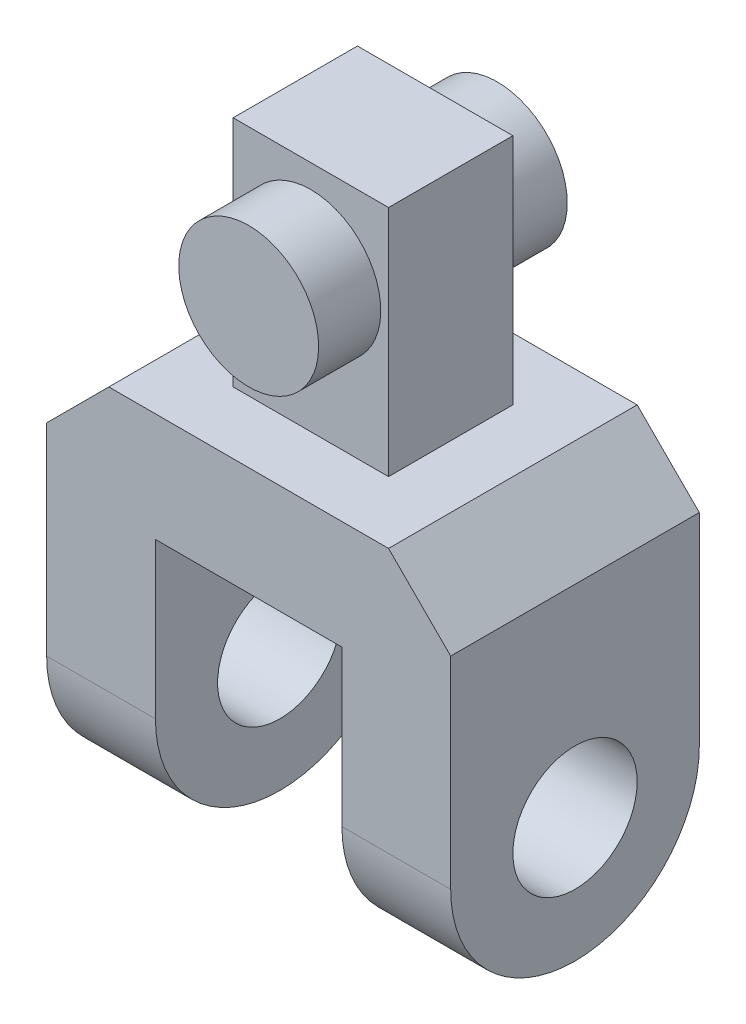
ISO-10303-21;
HEADER;
FILE_DESCRIPTION(('STEP AP214'),'2;1');
FILE_NAME('part.step','',(''),(''),'','','');
FILE_SCHEMA(('AUTOMOTIVE_DESIGN { 1 0 10303 214 1 1 1 1 }'));
ENDSEC;
DATA;
#1=APPLICATION_CONTEXT('core data for automotive mechanical design processes');
#2=APPLICATION_PROTOCOL_DEFINITION('international standard','automotive_design',2000,#1);
#3=PRODUCT_CONTEXT('',#1,'mechanical');
#4=PRODUCT('Part','Part','',(#3));
#5=PRODUCT_RELATED_PRODUCT_CATEGORY('part','',(#4));
#6=PRODUCT_DEFINITION_FORMATION('','',#4);
#7=PRODUCT_DEFINITION_CONTEXT('part definition',#1,'design');
#8=PRODUCT_DEFINITION('design','',#6,#7);
#9=PRODUCT_DEFINITION_SHAPE('','',#8);
#10=(LENGTH_UNIT() NAMED_UNIT(*) SI_UNIT(.MILLI.,.METRE.));
#11=(NAMED_UNIT(*) PLANE_ANGLE_UNIT() SI_UNIT($,.RADIAN.));
#12=(NAMED_UNIT(*) SI_UNIT($,.STERADIAN.) SOLID_ANGLE_UNIT());
#13=UNCERTAINTY_MEASURE_WITH_UNIT(LENGTH_MEASURE(1.E-05),#10,'distance_accuracy_value','');
#14=(GEOMETRIC_REPRESENTATION_CONTEXT(3) GLOBAL_UNCERTAINTY_ASSIGNED_CONTEXT((#13)) GLOBAL_UNIT_ASSIGNED_CONTEXT((#10,
#11,#12)) REPRESENTATION_CONTEXT('',''));
#15=CARTESIAN_POINT('',(0.,0.,0.));
#16=DIRECTION('',(0.,0.,1.));
#17=DIRECTION('',(1.,0.,0.));
#18=AXIS2_PLACEMENT_3D('',#15,#16,#17);
#19=CARTESIAN_POINT('',(-5.,32.,4.00000000000002));
#20=DIRECTION('',(0.,0.,-1.));
#21=DIRECTION('',(0.,1.,0.));
#22=AXIS2_PLACEMENT_3D('',#19,#20,#21);
#23=PLANE('',#22);
#24=DIRECTION('',(1.,0.,0.));
#25=VECTOR('',#24,1.);
#26=CARTESIAN_POINT('',(-5.,17.,4.00000000000001));
#27=LINE('',#26,#25);
#28=CARTESIAN_POINT('',(-5.,17.,4.00000000000001));
#29=VERTEX_POINT('',#28);
#30=CARTESIAN_POINT('',(5.,17.,4.00000000000001));
#31=VERTEX_POINT('',#30);
#32=EDGE_CURVE('E368',#29,#31,#27,.T.);
#33=ORIENTED_EDGE('',*,*,#32,.T.);
#34=DIRECTION('',(0.,-1.,0.));
#35=VECTOR('',#34,1.);
#36=CARTESIAN_POINT('',(5.,32.,4.00000000000002));
#37=LINE('',#36,#35);
#38=CARTESIAN_POINT('',(5.,32.,4.00000000000002));
#39=VERTEX_POINT('',#38);
#40=EDGE_CURVE('E143',#39,#31,#37,.T.);
#41=ORIENTED_EDGE('',*,*,#40,.F.);
#42=DIRECTION('',(1.,0.,0.));
#43=VECTOR('',#42,1.);
#44=CARTESIAN_POINT('',(-5.,32.,4.00000000000002));
#45=LINE('',#44,#43);
#46=CARTESIAN_POINT('',(-5.,32.,4.00000000000002));
#47=VERTEX_POINT('',#46);
#48=EDGE_CURVE('E136',#47,#39,#45,.T.);
#49=ORIENTED_EDGE('',*,*,#48,.F.);
#50=DIRECTION('',(0.,-1.,0.));
#51=VECTOR('',#50,1.);
#52=CARTESIAN_POINT('',(-5.,32.,4.00000000000002));
#53=LINE('',#52,#51);
#54=EDGE_CURVE('E140',#47,#29,#53,.T.);
#55=ORIENTED_EDGE('',*,*,#54,.T.);
#56=EDGE_LOOP('',(#33,#41,#49,#55));
#57=FACE_BOUND('',#56,.T.);
#58=CARTESIAN_POINT('',(0.,26.,4.00000000000001));
#59=DIRECTION('',(0.,0.,-1.));
#60=DIRECTION('',(0.,1.,0.));
#61=AXIS2_PLACEMENT_3D('',#58,#59,#60);
#62=CIRCLE('',#61,4.5);
#63=CARTESIAN_POINT('',(0.,30.5,4.00000000000002));
#64=VERTEX_POINT('',#63);
#65=EDGE_CURVE('E11',#64,#64,#62,.F.);
#66=ORIENTED_EDGE('',*,*,#65,.F.);
#67=EDGE_LOOP('',(#66));
#68=FACE_BOUND('',#67,.T.);
#69=ADVANCED_FACE('F34',(#57,#68),#23,.F.);
#70=CARTESIAN_POINT('',(-5.,32.,-3.99999999999999));
#71=DIRECTION('',(0.,0.,1.));
#72=DIRECTION('',(0.,-1.,0.));
#73=AXIS2_PLACEMENT_3D('',#70,#71,#72);
#74=PLANE('',#73);
#75=DIRECTION('',(-1.,0.,0.));
#76=VECTOR('',#75,1.);
#77=CARTESIAN_POINT('',(-5.,17.,-3.99999999999999));
#78=LINE('',#77,#76);
#79=CARTESIAN_POINT('',(5.,17.,-3.99999999999999));
#80=VERTEX_POINT('',#79);
#81=CARTESIAN_POINT('',(-5.,17.,-3.99999999999999));
#82=VERTEX_POINT('',#81);
#83=EDGE_CURVE('E155',#80,#82,#78,.T.);
#84=ORIENTED_EDGE('',*,*,#83,.T.);
#85=DIRECTION('',(0.,-1.,0.));
#86=VECTOR('',#85,1.);
#87=CARTESIAN_POINT('',(-5.,32.,-3.99999999999999));
#88=LINE('',#87,#86);
#89=CARTESIAN_POINT('',(-5.,32.,-3.99999999999999));
#90=VERTEX_POINT('',#89);
#91=EDGE_CURVE('E378',#90,#82,#88,.T.);
#92=ORIENTED_EDGE('',*,*,#91,.F.);
#93=DIRECTION('',(-1.,0.,0.));
#94=VECTOR('',#93,1.);
#95=CARTESIAN_POINT('',(-5.,32.,-3.99999999999999));
#96=LINE('',#95,#94);
#97=CARTESIAN_POINT('',(5.,32.,-3.99999999999999));
#98=VERTEX_POINT('',#97);
#99=EDGE_CURVE('E151',#98,#90,#96,.T.);
#100=ORIENTED_EDGE('',*,*,#99,.F.);
#101=DIRECTION('',(0.,-1.,0.));
#102=VECTOR('',#101,1.);
#103=CARTESIAN_POINT('',(5.,32.,-3.99999999999999));
#104=LINE('',#103,#102);
#105=EDGE_CURVE('E50',#98,#80,#104,.T.);
#106=ORIENTED_EDGE('',*,*,#105,.T.);
#107=EDGE_LOOP('',(#84,#92,#100,#106));
#108=FACE_BOUND('',#107,.T.);
#109=CARTESIAN_POINT('',(0.,26.,-3.99999999999999));
#110=DIRECTION('',(0.,0.,1.));
#111=DIRECTION('',(0.,-1.,0.));
#112=AXIS2_PLACEMENT_3D('',#109,#110,#111);
#113=CIRCLE('',#112,4.5);
#114=CARTESIAN_POINT('',(0.,21.5,-3.99999999999999));
#115=VERTEX_POINT('',#114);
#116=EDGE_CURVE('E38',#115,#115,#113,.F.);
#117=ORIENTED_EDGE('',*,*,#116,.F.);
#118=EDGE_LOOP('',(#117));
#119=FACE_BOUND('',#118,.T.);
#120=ADVANCED_FACE('F230',(#108,#119),#74,.F.);
#121=CARTESIAN_POINT('',(-13.,17.,8.00000000000001));
#122=DIRECTION('',(0.,1.,0.));
#123=DIRECTION('',(0.,0.,1.));
#124=AXIS2_PLACEMENT_3D('',#121,#122,#123);
#125=PLANE('',#124);
#126=DIRECTION('',(1.,0.,0.));
#127=VECTOR('',#126,1.);
#128=CARTESIAN_POINT('',(-13.,17.,8.00000000000001));
#129=LINE('',#128,#127);
#130=CARTESIAN_POINT('',(-9.,17.,8.00000000000001));
#131=VERTEX_POINT('',#130);
#132=CARTESIAN_POINT('',(8.99999999999999,17.,8.00000000000001));
#133=VERTEX_POINT('',#132);
#134=EDGE_CURVE('E189',#131,#133,#129,.T.);
#135=ORIENTED_EDGE('',*,*,#134,.T.);
#136=DIRECTION('',(0.,0.,-1.));
#137=VECTOR('',#136,1.);
#138=CARTESIAN_POINT('',(9.,17.,8.00000000000001));
#139=LINE('',#138,#137);
#140=CARTESIAN_POINT('',(8.99999999999999,17.,-7.99999999999999));
#141=VERTEX_POINT('',#140);
#142=EDGE_CURVE('E209',#133,#141,#139,.T.);
#143=ORIENTED_EDGE('',*,*,#142,.T.);
#144=DIRECTION('',(-1.,0.,0.));
#145=VECTOR('',#144,1.);
#146=CARTESIAN_POINT('',(-13.,17.,-7.99999999999999));
#147=LINE('',#146,#145);
#148=CARTESIAN_POINT('',(-9.00000000000001,17.,-7.99999999999999));
#149=VERTEX_POINT('',#148);
#150=EDGE_CURVE('E192',#141,#149,#147,.T.);
#151=ORIENTED_EDGE('',*,*,#150,.T.);
#152=DIRECTION('',(0.,0.,1.));
#153=VECTOR('',#152,1.);
#154=CARTESIAN_POINT('',(-9.,17.,8.00000000000001));
#155=LINE('',#154,#153);
#156=EDGE_CURVE('E206',#149,#131,#155,.T.);
#157=ORIENTED_EDGE('',*,*,#156,.T.);
#158=EDGE_LOOP('',(#135,#143,#151,#157));
#159=FACE_BOUND('',#158,.T.);
#160=ORIENTED_EDGE('',*,*,#32,.F.);
#161=DIRECTION('',(0.,0.,1.));
#162=VECTOR('',#161,1.);
#163=CARTESIAN_POINT('',(-5.,17.,4.00000000000001));
#164=LINE('',#163,#162);
#165=EDGE_CURVE('E159',#82,#29,#164,.T.);
#166=ORIENTED_EDGE('',*,*,#165,.F.);
#167=ORIENTED_EDGE('',*,*,#83,.F.);
#168=DIRECTION('',(0.,0.,-1.));
#169=VECTOR('',#168,1.);
#170=CARTESIAN_POINT('',(5.,17.,4.00000000000001));
#171=LINE('',#170,#169);
#172=EDGE_CURVE('E370',#31,#80,#171,.T.);
#173=ORIENTED_EDGE('',*,*,#172,.F.);
#174=EDGE_LOOP('',(#160,#166,#167,#173));
#175=FACE_BOUND('',#174,.T.);
#176=ADVANCED_FACE('F232',(#159,#175),#125,.T.);
#177=CARTESIAN_POINT('',(13.,0.,0.));
#178=DIRECTION('',(1.,0.,0.));
#179=DIRECTION('',(0.,0.,-1.));
#180=AXIS2_PLACEMENT_3D('',#177,#178,#179);
#181=PLANE('',#180);
#182=DIRECTION('',(0.,1.,0.));
#183=VECTOR('',#182,1.);
#184=CARTESIAN_POINT('',(13.,0.,-8.));
#185=LINE('',#184,#183);
#186=CARTESIAN_POINT('',(13.,0.,-8.));
#187=VERTEX_POINT('',#186);
#188=CARTESIAN_POINT('',(13.,13.,-8.));
#189=VERTEX_POINT('',#188);
#190=EDGE_CURVE('E326',#187,#189,#185,.T.);
#191=ORIENTED_EDGE('',*,*,#190,.T.);
#192=DIRECTION('',(0.,0.,1.));
#193=VECTOR('',#192,1.);
#194=CARTESIAN_POINT('',(13.,13.,0.));
#195=LINE('',#194,#193);
#196=CARTESIAN_POINT('',(13.,13.,8.));
#197=VERTEX_POINT('',#196);
#198=EDGE_CURVE('E217',#189,#197,#195,.T.);
#199=ORIENTED_EDGE('',*,*,#198,.T.);
#200=DIRECTION('',(0.,-1.,0.));
#201=VECTOR('',#200,1.);
#202=CARTESIAN_POINT('',(13.,0.,8.));
#203=LINE('',#202,#201);
#204=CARTESIAN_POINT('',(13.,0.,8.));
#205=VERTEX_POINT('',#204);
#206=EDGE_CURVE('E303',#197,#205,#203,.T.);
#207=ORIENTED_EDGE('',*,*,#206,.T.);
#208=CARTESIAN_POINT('',(13.,0.,0.));
#209=DIRECTION('',(1.,0.,0.));
#210=DIRECTION('',(0.,0.,-1.));
#211=AXIS2_PLACEMENT_3D('',#208,#209,#210);
#212=CIRCLE('',#211,8.);
#213=EDGE_CURVE('E323',#205,#187,#212,.T.);
#214=ORIENTED_EDGE('',*,*,#213,.T.);
#215=EDGE_LOOP('',(#191,#199,#207,#214));
#216=FACE_BOUND('',#215,.T.);
#217=CARTESIAN_POINT('',(13.,0.,0.));
#218=DIRECTION('',(1.,0.,0.));
#219=DIRECTION('',(0.,0.,-1.));
#220=AXIS2_PLACEMENT_3D('',#217,#218,#219);
#221=CIRCLE('',#220,4.);
#222=CARTESIAN_POINT('',(13.,0.,-4.));
#223=VERTEX_POINT('',#222);
#224=EDGE_CURVE('E317',#223,#223,#221,.T.);
#225=ORIENTED_EDGE('',*,*,#224,.F.);
#226=EDGE_LOOP('',(#225));
#227=FACE_BOUND('',#226,.T.);
#228=ADVANCED_FACE('F238',(#216,#227),#181,.T.);
#229=CARTESIAN_POINT('',(6.,0.,0.));
#230=DIRECTION('',(1.,0.,0.));
#231=DIRECTION('',(0.,0.,-1.));
#232=AXIS2_PLACEMENT_3D('',#229,#230,#231);
#233=PLANE('',#232);
#234=CARTESIAN_POINT('',(6.,0.,0.));
#235=DIRECTION('',(1.,0.,0.));
#236=DIRECTION('',(0.,0.,-1.));
#237=AXIS2_PLACEMENT_3D('',#234,#235,#236);
#238=CIRCLE('',#237,8.);
#239=CARTESIAN_POINT('',(6.,0.,8.));
#240=VERTEX_POINT('',#239);
#241=CARTESIAN_POINT('',(6.,0.,-8.));
#242=VERTEX_POINT('',#241);
#243=EDGE_CURVE('E320',#240,#242,#238,.T.);
#244=ORIENTED_EDGE('',*,*,#243,.F.);
#245=DIRECTION('',(0.,-1.,0.));
#246=VECTOR('',#245,1.);
#247=CARTESIAN_POINT('',(6.,0.,8.));
#248=LINE('',#247,#246);
#249=CARTESIAN_POINT('',(6.,10.,8.));
#250=VERTEX_POINT('',#249);
#251=EDGE_CURVE('E327',#250,#240,#248,.T.);
#252=ORIENTED_EDGE('',*,*,#251,.F.);
#253=DIRECTION('',(0.,0.,1.));
#254=VECTOR('',#253,1.);
#255=CARTESIAN_POINT('',(6.,10.,-8.));
#256=LINE('',#255,#254);
#257=CARTESIAN_POINT('',(6.,10.,-8.));
#258=VERTEX_POINT('',#257);
#259=EDGE_CURVE('E339',#258,#250,#256,.T.);
#260=ORIENTED_EDGE('',*,*,#259,.F.);
#261=DIRECTION('',(0.,1.,0.));
#262=VECTOR('',#261,1.);
#263=CARTESIAN_POINT('',(6.,0.,-8.));
#264=LINE('',#263,#262);
#265=EDGE_CURVE('E334',#242,#258,#264,.T.);
#266=ORIENTED_EDGE('',*,*,#265,.F.);
#267=EDGE_LOOP('',(#244,#252,#260,#266));
#268=FACE_BOUND('',#267,.T.);
#269=CARTESIAN_POINT('',(6.,0.,0.));
#270=DIRECTION('',(1.,0.,0.));
#271=DIRECTION('',(0.,0.,-1.));
#272=AXIS2_PLACEMENT_3D('',#269,#270,#271);
#273=CIRCLE('',#272,4.);
#274=CARTESIAN_POINT('',(6.,0.,-4.));
#275=VERTEX_POINT('',#274);
#276=EDGE_CURVE('E312',#275,#275,#273,.T.);
#277=ORIENTED_EDGE('',*,*,#276,.T.);
#278=EDGE_LOOP('',(#277));
#279=FACE_BOUND('',#278,.T.);
#280=ADVANCED_FACE('F278',(#268,#279),#233,.F.);
#281=CARTESIAN_POINT('',(13.,0.,0.));
#282=DIRECTION('',(-1.,0.,0.));
#283=DIRECTION('',(0.,0.,1.));
#284=AXIS2_PLACEMENT_3D('',#281,#282,#283);
#285=CYLINDRICAL_SURFACE('',#284,8.);
#286=ORIENTED_EDGE('',*,*,#243,.T.);
#287=DIRECTION('',(-1.,0.,0.));
#288=VECTOR('',#287,1.);
#289=CARTESIAN_POINT('',(13.,0.,-8.));
#290=LINE('',#289,#288);
#291=EDGE_CURVE('E210',#187,#242,#290,.T.);
#292=ORIENTED_EDGE('',*,*,#291,.F.);
#293=ORIENTED_EDGE('',*,*,#213,.F.);
#294=DIRECTION('',(-1.,0.,0.));
#295=VECTOR('',#294,1.);
#296=CARTESIAN_POINT('',(13.,0.,8.));
#297=LINE('',#296,#295);
#298=EDGE_CURVE('E331',#205,#240,#297,.T.);
#299=ORIENTED_EDGE('',*,*,#298,.T.);
#300=EDGE_LOOP('',(#286,#292,#293,#299));
#301=FACE_BOUND('',#300,.T.);
#302=ADVANCED_FACE('F282',(#301),#285,.T.);
#303=CARTESIAN_POINT('',(13.,0.,-8.));
#304=DIRECTION('',(0.,0.,1.));
#305=DIRECTION('',(0.,-1.,0.));
#306=AXIS2_PLACEMENT_3D('',#303,#304,#305);
#307=PLANE('',#306);
#308=ORIENTED_EDGE('',*,*,#150,.F.);
#309=DIRECTION('',(-0.707106781186546,0.707106781186549,0.));
#310=VECTOR('',#309,1.);
#311=CARTESIAN_POINT('',(9.,17.,-8.));
#312=LINE('',#311,#310);
#313=EDGE_CURVE('E215',#141,#189,#312,.F.);
#314=ORIENTED_EDGE('',*,*,#313,.T.);
#315=ORIENTED_EDGE('',*,*,#190,.F.);
#316=ORIENTED_EDGE('',*,*,#291,.T.);
#317=ORIENTED_EDGE('',*,*,#265,.T.);
#318=DIRECTION('',(-1.,0.,0.));
#319=VECTOR('',#318,1.);
#320=CARTESIAN_POINT('',(-13.,10.,-7.99999999999999));
#321=LINE('',#320,#319);
#322=CARTESIAN_POINT('',(-6.,10.,-8.));
#323=VERTEX_POINT('',#322);
#324=EDGE_CURVE('E193',#258,#323,#321,.T.);
#325=ORIENTED_EDGE('',*,*,#324,.T.);
#326=DIRECTION('',(0.,1.,0.));
#327=VECTOR('',#326,1.);
#328=CARTESIAN_POINT('',(-6.,0.,-8.));
#329=LINE('',#328,#327);
#330=CARTESIAN_POINT('',(-6.,0.,-8.));
#331=VERTEX_POINT('',#330);
#332=EDGE_CURVE('E179',#331,#323,#329,.T.);
#333=ORIENTED_EDGE('',*,*,#332,.F.);
#334=DIRECTION('',(1.,0.,0.));
#335=VECTOR('',#334,1.);
#336=CARTESIAN_POINT('',(-13.,0.,-8.));
#337=LINE('',#336,#335);
#338=CARTESIAN_POINT('',(-13.,0.,-8.));
#339=VERTEX_POINT('',#338);
#340=EDGE_CURVE('E175',#339,#331,#337,.T.);
#341=ORIENTED_EDGE('',*,*,#340,.F.);
#342=DIRECTION('',(0.,-1.,0.));
#343=VECTOR('',#342,1.);
#344=CARTESIAN_POINT('',(-13.,17.,-7.99999999999999));
#345=LINE('',#344,#343);
#346=CARTESIAN_POINT('',(-13.,13.,-7.99999999999999));
#347=VERTEX_POINT('',#346);
#348=EDGE_CURVE('E196',#347,#339,#345,.T.);
#349=ORIENTED_EDGE('',*,*,#348,.F.);
#350=DIRECTION('',(0.707106781186546,0.707106781186549,0.));
#351=VECTOR('',#350,1.);
#352=CARTESIAN_POINT('',(-9.,17.,-8.));
#353=LINE('',#352,#351);
#354=EDGE_CURVE('E213',#347,#149,#353,.T.);
#355=ORIENTED_EDGE('',*,*,#354,.T.);
#356=EDGE_LOOP('',(#308,#314,#315,#316,#317,#325,#333,#341,#349,#355));
#357=FACE_BOUND('',#356,.T.);
#358=ADVANCED_FACE('F286',(#357),#307,.F.);
#359=CARTESIAN_POINT('',(13.,0.,8.));
#360=DIRECTION('',(0.,0.,-1.));
#361=DIRECTION('',(0.,1.,0.));
#362=AXIS2_PLACEMENT_3D('',#359,#360,#361);
#363=PLANE('',#362);
#364=ORIENTED_EDGE('',*,*,#206,.F.);
#365=DIRECTION('',(0.707106781186546,-0.707106781186549,0.));
#366=VECTOR('',#365,1.);
#367=CARTESIAN_POINT('',(9.,17.,8.));
#368=LINE('',#367,#366);
#369=EDGE_CURVE('E220',#197,#133,#368,.F.);
#370=ORIENTED_EDGE('',*,*,#369,.T.);
#371=ORIENTED_EDGE('',*,*,#134,.F.);
#372=DIRECTION('',(-0.707106781186546,-0.707106781186549,0.));
#373=VECTOR('',#372,1.);
#374=CARTESIAN_POINT('',(-9.,17.,8.));
#375=LINE('',#374,#373);
#376=CARTESIAN_POINT('',(-13.,13.,8.00000000000001));
#377=VERTEX_POINT('',#376);
#378=EDGE_CURVE('E58',#131,#377,#375,.T.);
#379=ORIENTED_EDGE('',*,*,#378,.T.);
#380=DIRECTION('',(0.,-1.,0.));
#381=VECTOR('',#380,1.);
#382=CARTESIAN_POINT('',(-13.,17.,8.00000000000001));
#383=LINE('',#382,#381);
#384=CARTESIAN_POINT('',(-13.,0.,8.));
#385=VERTEX_POINT('',#384);
#386=EDGE_CURVE('E311',#377,#385,#383,.T.);
#387=ORIENTED_EDGE('',*,*,#386,.T.);
#388=DIRECTION('',(1.,0.,0.));
#389=VECTOR('',#388,1.);
#390=CARTESIAN_POINT('',(-13.,0.,8.));
#391=LINE('',#390,#389);
#392=CARTESIAN_POINT('',(-6.,0.,8.));
#393=VERTEX_POINT('',#392);
#394=EDGE_CURVE('E185',#385,#393,#391,.T.);
#395=ORIENTED_EDGE('',*,*,#394,.T.);
#396=DIRECTION('',(0.,-1.,0.));
#397=VECTOR('',#396,1.);
#398=CARTESIAN_POINT('',(-6.,0.,8.));
#399=LINE('',#398,#397);
#400=CARTESIAN_POINT('',(-6.,10.,8.));
#401=VERTEX_POINT('',#400);
#402=EDGE_CURVE('E176',#401,#393,#399,.T.);
#403=ORIENTED_EDGE('',*,*,#402,.F.);
#404=DIRECTION('',(1.,0.,0.));
#405=VECTOR('',#404,1.);
#406=CARTESIAN_POINT('',(-13.,10.,8.));
#407=LINE('',#406,#405);
#408=EDGE_CURVE('E187',#401,#250,#407,.T.);
#409=ORIENTED_EDGE('',*,*,#408,.T.);
#410=ORIENTED_EDGE('',*,*,#251,.T.);
#411=ORIENTED_EDGE('',*,*,#298,.F.);
#412=EDGE_LOOP('',(#364,#370,#371,#379,#387,#395,#403,#409,#410,#411));
#413=FACE_BOUND('',#412,.T.);
#414=ADVANCED_FACE('F274',(#413),#363,.F.);
#415=CARTESIAN_POINT('',(13.,0.,0.));
#416=DIRECTION('',(-1.,0.,0.));
#417=DIRECTION('',(0.,0.,1.));
#418=AXIS2_PLACEMENT_3D('',#415,#416,#417);
#419=CYLINDRICAL_SURFACE('',#418,4.);
#420=ORIENTED_EDGE('',*,*,#224,.T.);
#421=EDGE_LOOP('',(#420));
#422=FACE_BOUND('',#421,.T.);
#423=ORIENTED_EDGE('',*,*,#276,.F.);
#424=EDGE_LOOP('',(#423));
#425=FACE_BOUND('',#424,.T.);
#426=ADVANCED_FACE('F268',(#422,#425),#419,.F.);
#427=CARTESIAN_POINT('',(-13.,10.,8.));
#428=DIRECTION('',(0.,1.,0.));
#429=DIRECTION('',(0.,0.,1.));
#430=AXIS2_PLACEMENT_3D('',#427,#428,#429);
#431=PLANE('',#430);
#432=ORIENTED_EDGE('',*,*,#408,.F.);
#433=DIRECTION('',(0.,0.,1.));
#434=VECTOR('',#433,1.);
#435=CARTESIAN_POINT('',(-6.,10.,-8.));
#436=LINE('',#435,#434);
#437=EDGE_CURVE('E181',#323,#401,#436,.T.);
#438=ORIENTED_EDGE('',*,*,#437,.F.);
#439=ORIENTED_EDGE('',*,*,#324,.F.);
#440=ORIENTED_EDGE('',*,*,#259,.T.);
#441=EDGE_LOOP('',(#432,#438,#439,#440));
#442=FACE_BOUND('',#441,.T.);
#443=ADVANCED_FACE('F265',(#442),#431,.F.);
#444=CARTESIAN_POINT('',(-13.,17.,-7.99999999999999));
#445=DIRECTION('',(1.,0.,0.));
#446=DIRECTION('',(0.,0.,-1.));
#447=AXIS2_PLACEMENT_3D('',#444,#445,#446);
#448=PLANE('',#447);
#449=ORIENTED_EDGE('',*,*,#386,.F.);
#450=DIRECTION('',(0.,0.,-1.));
#451=VECTOR('',#450,1.);
#452=CARTESIAN_POINT('',(-13.,13.,-7.99999999999999));
#453=LINE('',#452,#451);
#454=EDGE_CURVE('E221',#377,#347,#453,.T.);
#455=ORIENTED_EDGE('',*,*,#454,.T.);
#456=ORIENTED_EDGE('',*,*,#348,.T.);
#457=CARTESIAN_POINT('',(-13.,0.,0.));
#458=DIRECTION('',(1.,0.,0.));
#459=DIRECTION('',(0.,0.,-1.));
#460=AXIS2_PLACEMENT_3D('',#457,#458,#459);
#461=CIRCLE('',#460,8.);
#462=EDGE_CURVE('E172',#385,#339,#461,.T.);
#463=ORIENTED_EDGE('',*,*,#462,.F.);
#464=EDGE_LOOP('',(#449,#455,#456,#463));
#465=FACE_BOUND('',#464,.T.);
#466=CARTESIAN_POINT('',(-13.,0.,0.));
#467=DIRECTION('',(1.,0.,0.));
#468=DIRECTION('',(0.,0.,-1.));
#469=AXIS2_PLACEMENT_3D('',#466,#467,#468);
#470=CIRCLE('',#469,4.);
#471=CARTESIAN_POINT('',(-13.,0.,-4.));
#472=VERTEX_POINT('',#471);
#473=EDGE_CURVE('E164',#472,#472,#470,.T.);
#474=ORIENTED_EDGE('',*,*,#473,.T.);
#475=EDGE_LOOP('',(#474));
#476=FACE_BOUND('',#475,.T.);
#477=ADVANCED_FACE('F262',(#465,#476),#448,.F.);
#478=CARTESIAN_POINT('',(-13.,0.,0.));
#479=DIRECTION('',(1.,0.,0.));
#480=DIRECTION('',(0.,0.,-1.));
#481=AXIS2_PLACEMENT_3D('',#478,#479,#480);
#482=CYLINDRICAL_SURFACE('',#481,8.);
#483=CARTESIAN_POINT('',(-6.,0.,0.));
#484=DIRECTION('',(1.,0.,0.));
#485=DIRECTION('',(0.,0.,-1.));
#486=AXIS2_PLACEMENT_3D('',#483,#484,#485);
#487=CIRCLE('',#486,8.);
#488=EDGE_CURVE('E170',#393,#331,#487,.T.);
#489=ORIENTED_EDGE('',*,*,#488,.F.);
#490=ORIENTED_EDGE('',*,*,#394,.F.);
#491=ORIENTED_EDGE('',*,*,#462,.T.);
#492=ORIENTED_EDGE('',*,*,#340,.T.);
#493=EDGE_LOOP('',(#489,#490,#491,#492));
#494=FACE_BOUND('',#493,.T.);
#495=ADVANCED_FACE('F259',(#494),#482,.T.);
#496=CARTESIAN_POINT('',(-6.,0.,0.));
#497=DIRECTION('',(1.,0.,0.));
#498=DIRECTION('',(0.,0.,-1.));
#499=AXIS2_PLACEMENT_3D('',#496,#497,#498);
#500=PLANE('',#499);
#501=CARTESIAN_POINT('',(-6.,0.,0.));
#502=DIRECTION('',(1.,0.,0.));
#503=DIRECTION('',(0.,0.,-1.));
#504=AXIS2_PLACEMENT_3D('',#501,#502,#503);
#505=CIRCLE('',#504,4.);
#506=CARTESIAN_POINT('',(-6.,0.,-4.));
#507=VERTEX_POINT('',#506);
#508=EDGE_CURVE('E161',#507,#507,#505,.T.);
#509=ORIENTED_EDGE('',*,*,#508,.F.);
#510=EDGE_LOOP('',(#509));
#511=FACE_BOUND('',#510,.T.);
#512=ORIENTED_EDGE('',*,*,#488,.T.);
#513=ORIENTED_EDGE('',*,*,#332,.T.);
#514=ORIENTED_EDGE('',*,*,#437,.T.);
#515=ORIENTED_EDGE('',*,*,#402,.T.);
#516=EDGE_LOOP('',(#512,#513,#514,#515));
#517=FACE_BOUND('',#516,.T.);
#518=ADVANCED_FACE('F255',(#511,#517),#500,.T.);
#519=CARTESIAN_POINT('',(-13.,0.,0.));
#520=DIRECTION('',(1.,0.,0.));
#521=DIRECTION('',(0.,0.,-1.));
#522=AXIS2_PLACEMENT_3D('',#519,#520,#521);
#523=CYLINDRICAL_SURFACE('',#522,4.);
#524=ORIENTED_EDGE('',*,*,#473,.F.);
#525=EDGE_LOOP('',(#524));
#526=FACE_BOUND('',#525,.T.);
#527=ORIENTED_EDGE('',*,*,#508,.T.);
#528=EDGE_LOOP('',(#527));
#529=FACE_BOUND('',#528,.T.);
#530=ADVANCED_FACE('F251',(#526,#529),#523,.F.);
#531=CARTESIAN_POINT('',(9.,17.,8.00000000000001));
#532=DIRECTION('',(-0.707106781186549,-0.707106781186546,0.));
#533=DIRECTION('',(0.707106781186546,-0.707106781186549,0.));
#534=AXIS2_PLACEMENT_3D('',#531,#532,#533);
#535=PLANE('',#534);
#536=ORIENTED_EDGE('',*,*,#369,.F.);
#537=ORIENTED_EDGE('',*,*,#198,.F.);
#538=ORIENTED_EDGE('',*,*,#313,.F.);
#539=ORIENTED_EDGE('',*,*,#142,.F.);
#540=EDGE_LOOP('',(#536,#537,#538,#539));
#541=FACE_BOUND('',#540,.T.);
#542=ADVANCED_FACE('F254',(#541),#535,.F.);
#543=CARTESIAN_POINT('',(-9.,17.,8.00000000000001));
#544=DIRECTION('',(-0.707106781186549,0.707106781186546,0.));
#545=DIRECTION('',(-0.707106781186546,-0.707106781186549,0.));
#546=AXIS2_PLACEMENT_3D('',#543,#544,#545);
#547=PLANE('',#546);
#548=ORIENTED_EDGE('',*,*,#354,.F.);
#549=ORIENTED_EDGE('',*,*,#454,.F.);
#550=ORIENTED_EDGE('',*,*,#378,.F.);
#551=ORIENTED_EDGE('',*,*,#156,.F.);
#552=EDGE_LOOP('',(#548,#549,#550,#551));
#553=FACE_BOUND('',#552,.T.);
#554=ADVANCED_FACE('F36',(#553),#547,.T.);
#555=CARTESIAN_POINT('',(-5.,32.,4.00000000000002));
#556=DIRECTION('',(1.,0.,0.));
#557=DIRECTION('',(0.,0.,-1.));
#558=AXIS2_PLACEMENT_3D('',#555,#556,#557);
#559=PLANE('',#558);
#560=ORIENTED_EDGE('',*,*,#165,.T.);
#561=ORIENTED_EDGE('',*,*,#54,.F.);
#562=DIRECTION('',(0.,0.,1.));
#563=VECTOR('',#562,1.);
#564=CARTESIAN_POINT('',(-5.,32.,4.00000000000002));
#565=LINE('',#564,#563);
#566=EDGE_CURVE('E147',#90,#47,#565,.T.);
#567=ORIENTED_EDGE('',*,*,#566,.F.);
#568=ORIENTED_EDGE('',*,*,#91,.T.);
#569=EDGE_LOOP('',(#560,#561,#567,#568));
#570=FACE_BOUND('',#569,.T.);
#571=ADVANCED_FACE('F157',(#570),#559,.F.);
#572=CARTESIAN_POINT('',(5.,32.,4.00000000000002));
#573=DIRECTION('',(-1.,0.,0.));
#574=DIRECTION('',(0.,0.,1.));
#575=AXIS2_PLACEMENT_3D('',#572,#573,#574);
#576=PLANE('',#575);
#577=ORIENTED_EDGE('',*,*,#172,.T.);
#578=ORIENTED_EDGE('',*,*,#105,.F.);
#579=DIRECTION('',(0.,0.,-1.));
#580=VECTOR('',#579,1.);
#581=CARTESIAN_POINT('',(5.,32.,4.00000000000002));
#582=LINE('',#581,#580);
#583=EDGE_CURVE('E146',#39,#98,#582,.T.);
#584=ORIENTED_EDGE('',*,*,#583,.F.);
#585=ORIENTED_EDGE('',*,*,#40,.T.);
#586=EDGE_LOOP('',(#577,#578,#584,#585));
#587=FACE_BOUND('',#586,.T.);
#588=ADVANCED_FACE('F245',(#587),#576,.F.);
#589=CARTESIAN_POINT('',(-5.,32.,-3.99999999999999));
#590=DIRECTION('',(0.,-1.,0.));
#591=DIRECTION('',(0.,0.,-1.));
#592=AXIS2_PLACEMENT_3D('',#589,#590,#591);
#593=PLANE('',#592);
#594=ORIENTED_EDGE('',*,*,#566,.T.);
#595=ORIENTED_EDGE('',*,*,#48,.T.);
#596=ORIENTED_EDGE('',*,*,#583,.T.);
#597=ORIENTED_EDGE('',*,*,#99,.T.);
#598=EDGE_LOOP('',(#594,#595,#596,#597));
#599=FACE_BOUND('',#598,.T.);
#600=ADVANCED_FACE('F150',(#599),#593,.F.);
#601=CARTESIAN_POINT('',(0.,26.,-8.));
#602=DIRECTION('',(0.,0.,1.));
#603=DIRECTION('',(1.,0.,0.));
#604=AXIS2_PLACEMENT_3D('',#601,#602,#603);
#605=PLANE('',#604);
#606=CARTESIAN_POINT('',(0.,26.,-8.));
#607=DIRECTION('',(0.,0.,1.));
#608=DIRECTION('',(1.,0.,0.));
#609=AXIS2_PLACEMENT_3D('',#606,#607,#608);
#610=CIRCLE('',#609,4.5);
#611=CARTESIAN_POINT('',(4.5,26.,-8.));
#612=VERTEX_POINT('',#611);
#613=EDGE_CURVE('E381',#612,#612,#610,.T.);
#614=ORIENTED_EDGE('',*,*,#613,.F.);
#615=EDGE_LOOP('',(#614));
#616=FACE_BOUND('',#615,.T.);
#617=ADVANCED_FACE('F398',(#616),#605,.F.);
#618=CARTESIAN_POINT('',(0.,26.,8.));
#619=DIRECTION('',(0.,0.,-1.));
#620=DIRECTION('',(-1.,0.,0.));
#621=AXIS2_PLACEMENT_3D('',#618,#619,#620);
#622=CYLINDRICAL_SURFACE('',#621,4.5);
#623=ORIENTED_EDGE('',*,*,#613,.T.);
#624=EDGE_LOOP('',(#623));
#625=FACE_BOUND('',#624,.T.);
#626=ORIENTED_EDGE('',*,*,#116,.T.);
#627=EDGE_LOOP('',(#626));
#628=FACE_BOUND('',#627,.T.);
#629=ADVANCED_FACE('F228',(#625,#628),#622,.T.);
#630=CARTESIAN_POINT('',(0.,26.,8.));
#631=DIRECTION('',(0.,0.,1.));
#632=DIRECTION('',(1.,0.,0.));
#633=AXIS2_PLACEMENT_3D('',#630,#631,#632);
#634=CIRCLE('',#633,4.5);
#635=CARTESIAN_POINT('',(4.5,26.,8.));
#636=VERTEX_POINT('',#635);
#637=EDGE_CURVE('E373',#636,#636,#634,.T.);
#638=ORIENTED_EDGE('',*,*,#637,.F.);
#639=EDGE_LOOP('',(#638));
#640=FACE_BOUND('',#639,.T.);
#641=ORIENTED_EDGE('',*,*,#65,.T.);
#642=EDGE_LOOP('',(#641));
#643=FACE_BOUND('',#642,.T.);
#644=ADVANCED_FACE('F389',(#640,#643),#622,.T.);
#645=CARTESIAN_POINT('',(0.,26.,8.));
#646=DIRECTION('',(0.,0.,1.));
#647=DIRECTION('',(1.,0.,0.));
#648=AXIS2_PLACEMENT_3D('',#645,#646,#647);
#649=PLANE('',#648);
#650=ORIENTED_EDGE('',*,*,#637,.T.);
#651=EDGE_LOOP('',(#650));
#652=FACE_BOUND('',#651,.T.);
#653=ADVANCED_FACE('F387',(#652),#649,.T.);
#654=CLOSED_SHELL('',(#69,#120,#176,#228,#280,#302,#358,#414,#426,#443,#477,#495,#518,#530,#542,
#554,#571,#588,#600,#617,#629,#644,#653));
#655=MANIFOLD_SOLID_BREP('B2',#654);
#656=ADVANCED_BREP_SHAPE_REPRESENTATION('',(#18,#655),#14);
#657=SHAPE_DEFINITION_REPRESENTATION(#9,#656);
ENDSEC;
END-ISO-10303-21;
